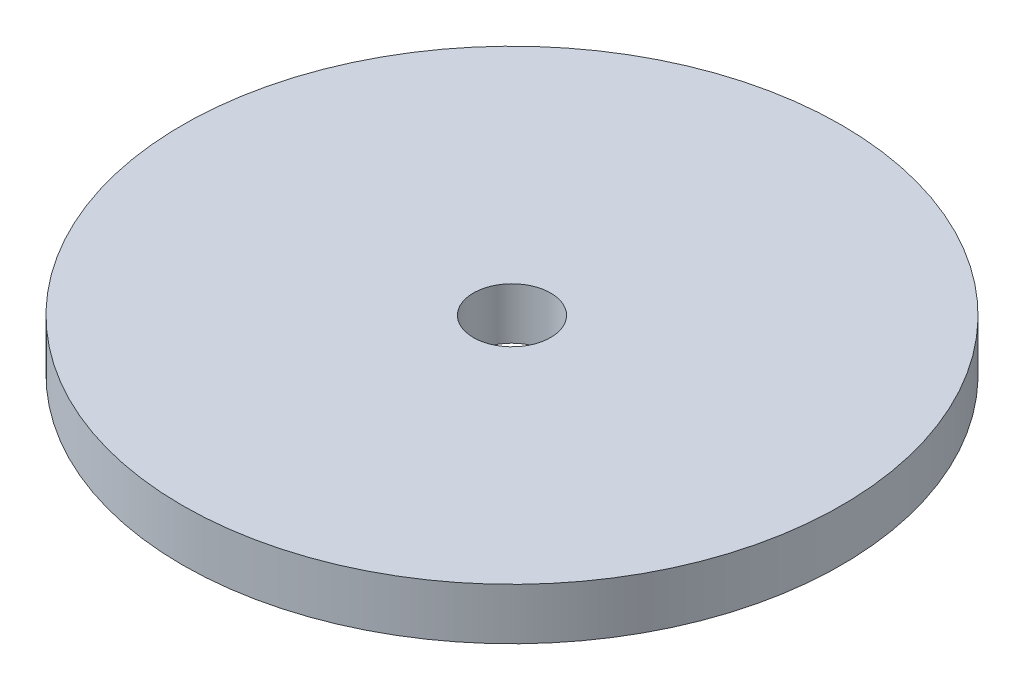
ISO-10303-21;
HEADER;
FILE_DESCRIPTION(('STEP AP214'),'2;1');
FILE_NAME('part.step','',(''),(''),'','','');
FILE_SCHEMA(('AUTOMOTIVE_DESIGN { 1 0 10303 214 1 1 1 1 }'));
ENDSEC;
DATA;
#1=APPLICATION_CONTEXT('core data for automotive mechanical design processes');
#2=APPLICATION_PROTOCOL_DEFINITION('international standard','automotive_design',2000,#1);
#3=PRODUCT_CONTEXT('',#1,'mechanical');
#4=PRODUCT('Part','Part','',(#3));
#5=PRODUCT_RELATED_PRODUCT_CATEGORY('part','',(#4));
#6=PRODUCT_DEFINITION_FORMATION('','',#4);
#7=PRODUCT_DEFINITION_CONTEXT('part definition',#1,'design');
#8=PRODUCT_DEFINITION('design','',#6,#7);
#9=PRODUCT_DEFINITION_SHAPE('','',#8);
#10=(LENGTH_UNIT() NAMED_UNIT(*) SI_UNIT(.MILLI.,.METRE.));
#11=(NAMED_UNIT(*) PLANE_ANGLE_UNIT() SI_UNIT($,.RADIAN.));
#12=(NAMED_UNIT(*) SI_UNIT($,.STERADIAN.) SOLID_ANGLE_UNIT());
#13=UNCERTAINTY_MEASURE_WITH_UNIT(LENGTH_MEASURE(1.E-05),#10,'distance_accuracy_value','');
#14=(GEOMETRIC_REPRESENTATION_CONTEXT(3) GLOBAL_UNCERTAINTY_ASSIGNED_CONTEXT((#13)) GLOBAL_UNIT_ASSIGNED_CONTEXT((#10,
#11,#12)) REPRESENTATION_CONTEXT('',''));
#15=CARTESIAN_POINT('',(0.,0.,0.));
#16=DIRECTION('',(0.,0.,1.));
#17=DIRECTION('',(1.,0.,0.));
#18=AXIS2_PLACEMENT_3D('',#15,#16,#17);
#19=CARTESIAN_POINT('',(0.,6.35,0.));
#20=DIRECTION('',(0.,1.,0.));
#21=DIRECTION('',(0.,0.,1.));
#22=AXIS2_PLACEMENT_3D('',#19,#20,#21);
#23=PLANE('',#22);
#24=CARTESIAN_POINT('',(0.,6.35,0.));
#25=DIRECTION('',(0.,1.,0.));
#26=DIRECTION('',(0.,0.,1.));
#27=AXIS2_PLACEMENT_3D('',#24,#25,#26);
#28=CIRCLE('',#27,40.64);
#29=CARTESIAN_POINT('',(0.,6.35,40.64));
#30=VERTEX_POINT('',#29);
#31=EDGE_CURVE('E10',#30,#30,#28,.T.);
#32=ORIENTED_EDGE('',*,*,#31,.T.);
#33=EDGE_LOOP('',(#32));
#34=FACE_BOUND('',#33,.T.);
#35=CARTESIAN_POINT('',(0.,6.35,0.));
#36=DIRECTION('',(0.,1.,0.));
#37=DIRECTION('',(0.,0.,1.));
#38=AXIS2_PLACEMENT_3D('',#35,#36,#37);
#39=CIRCLE('',#38,4.7625);
#40=CARTESIAN_POINT('',(0.,6.35,4.7625));
#41=VERTEX_POINT('',#40);
#42=EDGE_CURVE('E42',#41,#41,#39,.T.);
#43=ORIENTED_EDGE('',*,*,#42,.F.);
#44=EDGE_LOOP('',(#43));
#45=FACE_BOUND('',#44,.T.);
#46=ADVANCED_FACE('F31',(#34,#45),#23,.T.);
#47=CARTESIAN_POINT('',(0.,0.,0.));
#48=DIRECTION('',(0.,1.,0.));
#49=DIRECTION('',(0.,0.,1.));
#50=AXIS2_PLACEMENT_3D('',#47,#48,#49);
#51=PLANE('',#50);
#52=CARTESIAN_POINT('',(0.,0.,0.));
#53=DIRECTION('',(0.,1.,0.));
#54=DIRECTION('',(0.,0.,1.));
#55=AXIS2_PLACEMENT_3D('',#52,#53,#54);
#56=CIRCLE('',#55,40.64);
#57=CARTESIAN_POINT('',(0.,0.,40.64));
#58=VERTEX_POINT('',#57);
#59=EDGE_CURVE('E35',#58,#58,#56,.T.);
#60=ORIENTED_EDGE('',*,*,#59,.F.);
#61=EDGE_LOOP('',(#60));
#62=FACE_BOUND('',#61,.T.);
#63=CARTESIAN_POINT('',(0.,0.,0.));
#64=DIRECTION('',(0.,1.,0.));
#65=DIRECTION('',(0.,0.,1.));
#66=AXIS2_PLACEMENT_3D('',#63,#64,#65);
#67=CIRCLE('',#66,4.7625);
#68=CARTESIAN_POINT('',(0.,0.,4.7625));
#69=VERTEX_POINT('',#68);
#70=EDGE_CURVE('E44',#69,#69,#67,.T.);
#71=ORIENTED_EDGE('',*,*,#70,.T.);
#72=EDGE_LOOP('',(#71));
#73=FACE_BOUND('',#72,.T.);
#74=ADVANCED_FACE('F54',(#62,#73),#51,.F.);
#75=CARTESIAN_POINT('',(0.,6.35,0.));
#76=DIRECTION('',(0.,-1.,0.));
#77=DIRECTION('',(0.,0.,-1.));
#78=AXIS2_PLACEMENT_3D('',#75,#76,#77);
#79=CYLINDRICAL_SURFACE('',#78,40.64);
#80=ORIENTED_EDGE('',*,*,#31,.F.);
#81=EDGE_LOOP('',(#80));
#82=FACE_BOUND('',#81,.T.);
#83=ORIENTED_EDGE('',*,*,#59,.T.);
#84=EDGE_LOOP('',(#83));
#85=FACE_BOUND('',#84,.T.);
#86=ADVANCED_FACE('F33',(#82,#85),#79,.T.);
#87=CARTESIAN_POINT('',(0.,6.35,0.));
#88=DIRECTION('',(0.,-1.,0.));
#89=DIRECTION('',(0.,0.,-1.));
#90=AXIS2_PLACEMENT_3D('',#87,#88,#89);
#91=CYLINDRICAL_SURFACE('',#90,4.7625);
#92=ORIENTED_EDGE('',*,*,#42,.T.);
#93=EDGE_LOOP('',(#92));
#94=FACE_BOUND('',#93,.T.);
#95=ORIENTED_EDGE('',*,*,#70,.F.);
#96=EDGE_LOOP('',(#95));
#97=FACE_BOUND('',#96,.T.);
#98=ADVANCED_FACE('F50',(#94,#97),#91,.F.);
#99=CLOSED_SHELL('',(#46,#74,#86,#98));
#100=MANIFOLD_SOLID_BREP('B2',#99);
#101=ADVANCED_BREP_SHAPE_REPRESENTATION('',(#18,#100),#14);
#102=SHAPE_DEFINITION_REPRESENTATION(#9,#101);
ENDSEC;
END-ISO-10303-21;
